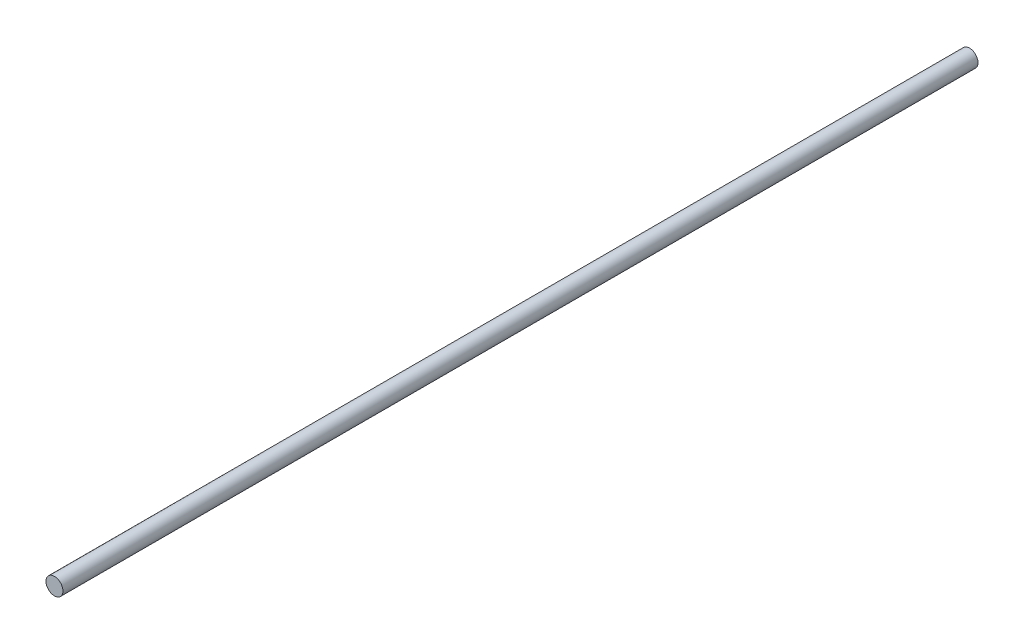
ISO-10303-21;
HEADER;
FILE_DESCRIPTION(('STEP AP214'),'2;1');
FILE_NAME('part.step','',(''),(''),'','','');
FILE_SCHEMA(('AUTOMOTIVE_DESIGN { 1 0 10303 214 1 1 1 1 }'));
ENDSEC;
DATA;
#1=APPLICATION_CONTEXT('core data for automotive mechanical design processes');
#2=APPLICATION_PROTOCOL_DEFINITION('international standard','automotive_design',2000,#1);
#3=PRODUCT_CONTEXT('',#1,'mechanical');
#4=PRODUCT('Part','Part','',(#3));
#5=PRODUCT_RELATED_PRODUCT_CATEGORY('part','',(#4));
#6=PRODUCT_DEFINITION_FORMATION('','',#4);
#7=PRODUCT_DEFINITION_CONTEXT('part definition',#1,'design');
#8=PRODUCT_DEFINITION('design','',#6,#7);
#9=PRODUCT_DEFINITION_SHAPE('','',#8);
#10=(LENGTH_UNIT() NAMED_UNIT(*) SI_UNIT(.MILLI.,.METRE.));
#11=(NAMED_UNIT(*) PLANE_ANGLE_UNIT() SI_UNIT($,.RADIAN.));
#12=(NAMED_UNIT(*) SI_UNIT($,.STERADIAN.) SOLID_ANGLE_UNIT());
#13=UNCERTAINTY_MEASURE_WITH_UNIT(LENGTH_MEASURE(1.E-05),#10,'distance_accuracy_value','');
#14=(GEOMETRIC_REPRESENTATION_CONTEXT(3) GLOBAL_UNCERTAINTY_ASSIGNED_CONTEXT((#13)) GLOBAL_UNIT_ASSIGNED_CONTEXT((#10,
#11,#12)) REPRESENTATION_CONTEXT('',''));
#15=CARTESIAN_POINT('',(0.,0.,0.));
#16=DIRECTION('',(0.,0.,1.));
#17=DIRECTION('',(1.,0.,0.));
#18=AXIS2_PLACEMENT_3D('',#15,#16,#17);
#19=CARTESIAN_POINT('',(0.,0.,428.625));
#20=DIRECTION('',(0.,0.,-1.));
#21=DIRECTION('',(-1.,0.,0.));
#22=AXIS2_PLACEMENT_3D('',#19,#20,#21);
#23=CYLINDRICAL_SURFACE('',#22,3.96875);
#24=CARTESIAN_POINT('',(0.,0.,428.625));
#25=DIRECTION('',(0.,0.,1.));
#26=DIRECTION('',(1.,0.,0.));
#27=AXIS2_PLACEMENT_3D('',#24,#25,#26);
#28=CIRCLE('',#27,3.96875);
#29=CARTESIAN_POINT('',(3.96875,0.,428.625));
#30=VERTEX_POINT('',#29);
#31=EDGE_CURVE('E10',#30,#30,#28,.T.);
#32=ORIENTED_EDGE('',*,*,#31,.F.);
#33=EDGE_LOOP('',(#32));
#34=FACE_BOUND('',#33,.T.);
#35=CARTESIAN_POINT('',(0.,0.,0.));
#36=DIRECTION('',(0.,0.,1.));
#37=DIRECTION('',(1.,0.,0.));
#38=AXIS2_PLACEMENT_3D('',#35,#36,#37);
#39=CIRCLE('',#38,3.96875);
#40=CARTESIAN_POINT('',(3.96875,0.,0.));
#41=VERTEX_POINT('',#40);
#42=EDGE_CURVE('E40',#41,#41,#39,.T.);
#43=ORIENTED_EDGE('',*,*,#42,.T.);
#44=EDGE_LOOP('',(#43));
#45=FACE_BOUND('',#44,.T.);
#46=ADVANCED_FACE('F37',(#34,#45),#23,.T.);
#47=CARTESIAN_POINT('',(0.,0.,428.625));
#48=DIRECTION('',(0.,0.,1.));
#49=DIRECTION('',(1.,0.,0.));
#50=AXIS2_PLACEMENT_3D('',#47,#48,#49);
#51=PLANE('',#50);
#52=ORIENTED_EDGE('',*,*,#31,.T.);
#53=EDGE_LOOP('',(#52));
#54=FACE_BOUND('',#53,.T.);
#55=ADVANCED_FACE('F54',(#54),#51,.T.);
#56=CARTESIAN_POINT('',(0.,0.,0.));
#57=DIRECTION('',(0.,0.,1.));
#58=DIRECTION('',(1.,0.,0.));
#59=AXIS2_PLACEMENT_3D('',#56,#57,#58);
#60=PLANE('',#59);
#61=ORIENTED_EDGE('',*,*,#42,.F.);
#62=EDGE_LOOP('',(#61));
#63=FACE_BOUND('',#62,.T.);
#64=ADVANCED_FACE('F52',(#63),#60,.F.);
#65=CLOSED_SHELL('',(#46,#55,#64));
#66=MANIFOLD_SOLID_BREP('B2',#65);
#67=ADVANCED_BREP_SHAPE_REPRESENTATION('',(#18,#66),#14);
#68=SHAPE_DEFINITION_REPRESENTATION(#9,#67);
ENDSEC;
END-ISO-10303-21;
